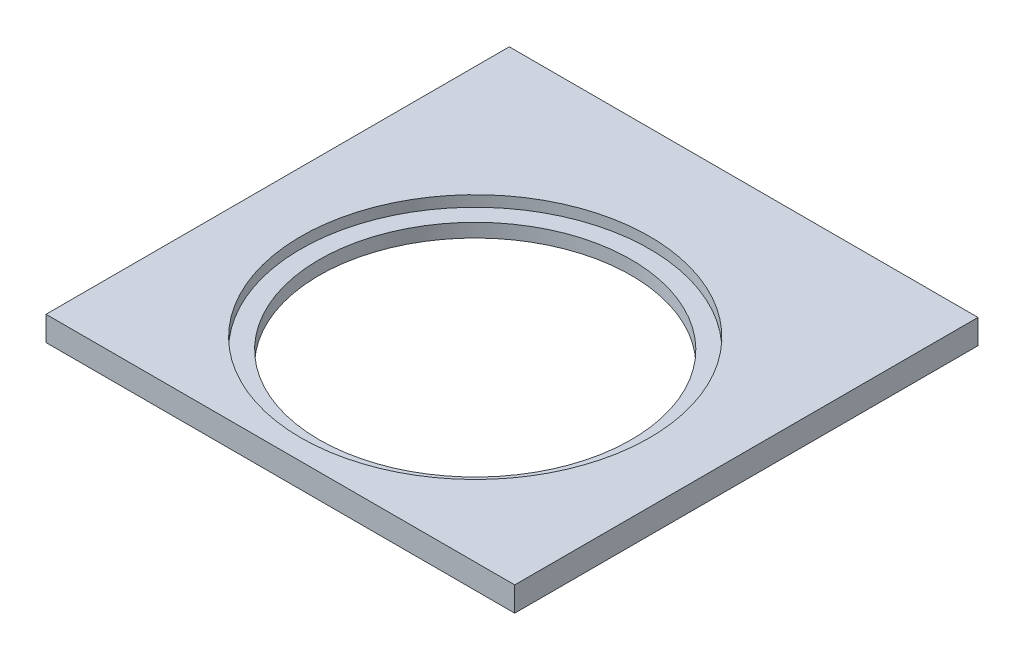
ISO-10303-21;
HEADER;
FILE_DESCRIPTION(('STEP AP214'),'2;1');
FILE_NAME('part.step','',(''),(''),'','','');
FILE_SCHEMA(('AUTOMOTIVE_DESIGN { 1 0 10303 214 1 1 1 1 }'));
ENDSEC;
DATA;
#1=APPLICATION_CONTEXT('core data for automotive mechanical design processes');
#2=APPLICATION_PROTOCOL_DEFINITION('international standard','automotive_design',2000,#1);
#3=PRODUCT_CONTEXT('',#1,'mechanical');
#4=PRODUCT('Part','Part','',(#3));
#5=PRODUCT_RELATED_PRODUCT_CATEGORY('part','',(#4));
#6=PRODUCT_DEFINITION_FORMATION('','',#4);
#7=PRODUCT_DEFINITION_CONTEXT('part definition',#1,'design');
#8=PRODUCT_DEFINITION('design','',#6,#7);
#9=PRODUCT_DEFINITION_SHAPE('','',#8);
#10=(LENGTH_UNIT() NAMED_UNIT(*) SI_UNIT(.MILLI.,.METRE.));
#11=(NAMED_UNIT(*) PLANE_ANGLE_UNIT() SI_UNIT($,.RADIAN.));
#12=(NAMED_UNIT(*) SI_UNIT($,.STERADIAN.) SOLID_ANGLE_UNIT());
#13=UNCERTAINTY_MEASURE_WITH_UNIT(LENGTH_MEASURE(1.E-05),#10,'distance_accuracy_value','');
#14=(GEOMETRIC_REPRESENTATION_CONTEXT(3) GLOBAL_UNCERTAINTY_ASSIGNED_CONTEXT((#13)) GLOBAL_UNIT_ASSIGNED_CONTEXT((#10,
#11,#12)) REPRESENTATION_CONTEXT('',''));
#15=CARTESIAN_POINT('',(0.,0.,0.));
#16=DIRECTION('',(0.,0.,1.));
#17=DIRECTION('',(1.,0.,0.));
#18=AXIS2_PLACEMENT_3D('',#15,#16,#17);
#19=CARTESIAN_POINT('',(0.,0.,27.));
#20=DIRECTION('',(0.,1.,0.));
#21=DIRECTION('',(0.,0.,1.));
#22=AXIS2_PLACEMENT_3D('',#19,#20,#21);
#23=CYLINDRICAL_SURFACE('',#22,114.5);
#24=CARTESIAN_POINT('',(0.,0.,27.));
#25=DIRECTION('',(0.,1.,0.));
#26=DIRECTION('',(0.,0.,1.));
#27=AXIS2_PLACEMENT_3D('',#24,#25,#26);
#28=CIRCLE('',#27,114.5);
#29=CARTESIAN_POINT('',(0.,0.,141.5));
#30=VERTEX_POINT('',#29);
#31=EDGE_CURVE('E104',#30,#30,#28,.T.);
#32=ORIENTED_EDGE('',*,*,#31,.F.);
#33=EDGE_LOOP('',(#32));
#34=FACE_BOUND('',#33,.T.);
#35=CARTESIAN_POINT('',(0.,10.,27.));
#36=DIRECTION('',(0.,1.,0.));
#37=DIRECTION('',(0.,0.,1.));
#38=AXIS2_PLACEMENT_3D('',#35,#36,#37);
#39=CIRCLE('',#38,114.5);
#40=CARTESIAN_POINT('',(0.,10.,141.5));
#41=VERTEX_POINT('',#40);
#42=EDGE_CURVE('E39',#41,#41,#39,.F.);
#43=ORIENTED_EDGE('',*,*,#42,.F.);
#44=EDGE_LOOP('',(#43));
#45=FACE_BOUND('',#44,.T.);
#46=ADVANCED_FACE('F35',(#34,#45),#23,.F.);
#47=CARTESIAN_POINT('',(-172.,18.,170.));
#48=DIRECTION('',(1.,0.,0.));
#49=DIRECTION('',(0.,0.,-1.));
#50=AXIS2_PLACEMENT_3D('',#47,#48,#49);
#51=PLANE('',#50);
#52=DIRECTION('',(0.,0.,1.));
#53=VECTOR('',#52,1.);
#54=CARTESIAN_POINT('',(-172.,0.,170.));
#55=LINE('',#54,#53);
#56=CARTESIAN_POINT('',(-172.,0.,-170.));
#57=VERTEX_POINT('',#56);
#58=CARTESIAN_POINT('',(-172.,0.,170.));
#59=VERTEX_POINT('',#58);
#60=EDGE_CURVE('E101',#57,#59,#55,.T.);
#61=ORIENTED_EDGE('',*,*,#60,.T.);
#62=DIRECTION('',(0.,-1.,0.));
#63=VECTOR('',#62,1.);
#64=CARTESIAN_POINT('',(-172.,18.,170.));
#65=LINE('',#64,#63);
#66=CARTESIAN_POINT('',(-172.,18.,170.));
#67=VERTEX_POINT('',#66);
#68=EDGE_CURVE('E11',#67,#59,#65,.T.);
#69=ORIENTED_EDGE('',*,*,#68,.F.);
#70=DIRECTION('',(0.,0.,1.));
#71=VECTOR('',#70,1.);
#72=CARTESIAN_POINT('',(-172.,18.,170.));
#73=LINE('',#72,#71);
#74=CARTESIAN_POINT('',(-172.,18.,-170.));
#75=VERTEX_POINT('',#74);
#76=EDGE_CURVE('E88',#75,#67,#73,.T.);
#77=ORIENTED_EDGE('',*,*,#76,.F.);
#78=DIRECTION('',(0.,-1.,0.));
#79=VECTOR('',#78,1.);
#80=CARTESIAN_POINT('',(-172.,18.,-170.));
#81=LINE('',#80,#79);
#82=EDGE_CURVE('E97',#75,#57,#81,.T.);
#83=ORIENTED_EDGE('',*,*,#82,.T.);
#84=EDGE_LOOP('',(#61,#69,#77,#83));
#85=FACE_BOUND('',#84,.T.);
#86=ADVANCED_FACE('F37',(#85),#51,.F.);
#87=CARTESIAN_POINT('',(172.,18.,170.));
#88=DIRECTION('',(0.,0.,-1.));
#89=DIRECTION('',(-1.,0.,0.));
#90=AXIS2_PLACEMENT_3D('',#87,#88,#89);
#91=PLANE('',#90);
#92=DIRECTION('',(1.,0.,0.));
#93=VECTOR('',#92,1.);
#94=CARTESIAN_POINT('',(172.,0.,170.));
#95=LINE('',#94,#93);
#96=CARTESIAN_POINT('',(172.,0.,170.));
#97=VERTEX_POINT('',#96);
#98=EDGE_CURVE('E92',#59,#97,#95,.T.);
#99=ORIENTED_EDGE('',*,*,#98,.T.);
#100=DIRECTION('',(0.,-1.,0.));
#101=VECTOR('',#100,1.);
#102=CARTESIAN_POINT('',(172.,18.,170.));
#103=LINE('',#102,#101);
#104=CARTESIAN_POINT('',(172.,18.,170.));
#105=VERTEX_POINT('',#104);
#106=EDGE_CURVE('E45',#105,#97,#103,.T.);
#107=ORIENTED_EDGE('',*,*,#106,.F.);
#108=DIRECTION('',(1.,0.,0.));
#109=VECTOR('',#108,1.);
#110=CARTESIAN_POINT('',(172.,18.,170.));
#111=LINE('',#110,#109);
#112=EDGE_CURVE('E83',#67,#105,#111,.T.);
#113=ORIENTED_EDGE('',*,*,#112,.F.);
#114=ORIENTED_EDGE('',*,*,#68,.T.);
#115=EDGE_LOOP('',(#99,#107,#113,#114));
#116=FACE_BOUND('',#115,.T.);
#117=ADVANCED_FACE('F91',(#116),#91,.F.);
#118=CARTESIAN_POINT('',(172.,18.,170.));
#119=DIRECTION('',(-1.,0.,0.));
#120=DIRECTION('',(0.,0.,1.));
#121=AXIS2_PLACEMENT_3D('',#118,#119,#120);
#122=PLANE('',#121);
#123=DIRECTION('',(0.,0.,-1.));
#124=VECTOR('',#123,1.);
#125=CARTESIAN_POINT('',(172.,0.,170.));
#126=LINE('',#125,#124);
#127=CARTESIAN_POINT('',(172.,0.,-170.));
#128=VERTEX_POINT('',#127);
#129=EDGE_CURVE('E70',#97,#128,#126,.T.);
#130=ORIENTED_EDGE('',*,*,#129,.T.);
#131=DIRECTION('',(0.,-1.,0.));
#132=VECTOR('',#131,1.);
#133=CARTESIAN_POINT('',(172.,18.,-170.));
#134=LINE('',#133,#132);
#135=CARTESIAN_POINT('',(172.,18.,-170.));
#136=VERTEX_POINT('',#135);
#137=EDGE_CURVE('E93',#136,#128,#134,.T.);
#138=ORIENTED_EDGE('',*,*,#137,.F.);
#139=DIRECTION('',(0.,0.,-1.));
#140=VECTOR('',#139,1.);
#141=CARTESIAN_POINT('',(172.,18.,170.));
#142=LINE('',#141,#140);
#143=EDGE_CURVE('E86',#105,#136,#142,.T.);
#144=ORIENTED_EDGE('',*,*,#143,.F.);
#145=ORIENTED_EDGE('',*,*,#106,.T.);
#146=EDGE_LOOP('',(#130,#138,#144,#145));
#147=FACE_BOUND('',#146,.T.);
#148=ADVANCED_FACE('F95',(#147),#122,.F.);
#149=CARTESIAN_POINT('',(172.,18.,-170.));
#150=DIRECTION('',(0.,0.,1.));
#151=DIRECTION('',(1.,0.,0.));
#152=AXIS2_PLACEMENT_3D('',#149,#150,#151);
#153=PLANE('',#152);
#154=DIRECTION('',(-1.,0.,0.));
#155=VECTOR('',#154,1.);
#156=CARTESIAN_POINT('',(172.,0.,-170.));
#157=LINE('',#156,#155);
#158=EDGE_CURVE('E76',#128,#57,#157,.T.);
#159=ORIENTED_EDGE('',*,*,#158,.T.);
#160=ORIENTED_EDGE('',*,*,#82,.F.);
#161=DIRECTION('',(-1.,0.,0.));
#162=VECTOR('',#161,1.);
#163=CARTESIAN_POINT('',(172.,18.,-170.));
#164=LINE('',#163,#162);
#165=EDGE_CURVE('E53',#136,#75,#164,.T.);
#166=ORIENTED_EDGE('',*,*,#165,.F.);
#167=ORIENTED_EDGE('',*,*,#137,.T.);
#168=EDGE_LOOP('',(#159,#160,#166,#167));
#169=FACE_BOUND('',#168,.T.);
#170=ADVANCED_FACE('F109',(#169),#153,.F.);
#171=CARTESIAN_POINT('',(0.,18.,0.));
#172=DIRECTION('',(0.,1.,0.));
#173=DIRECTION('',(0.,0.,1.));
#174=AXIS2_PLACEMENT_3D('',#171,#172,#173);
#175=PLANE('',#174);
#176=CARTESIAN_POINT('',(0.,18.,27.));
#177=DIRECTION('',(0.,1.,0.));
#178=DIRECTION('',(0.,0.,1.));
#179=AXIS2_PLACEMENT_3D('',#176,#177,#178);
#180=CIRCLE('',#179,128.);
#181=CARTESIAN_POINT('',(0.,18.,155.));
#182=VERTEX_POINT('',#181);
#183=EDGE_CURVE('E117',#182,#182,#180,.T.);
#184=ORIENTED_EDGE('',*,*,#183,.F.);
#185=EDGE_LOOP('',(#184));
#186=FACE_BOUND('',#185,.T.);
#187=ORIENTED_EDGE('',*,*,#76,.T.);
#188=ORIENTED_EDGE('',*,*,#112,.T.);
#189=ORIENTED_EDGE('',*,*,#143,.T.);
#190=ORIENTED_EDGE('',*,*,#165,.T.);
#191=EDGE_LOOP('',(#187,#188,#189,#190));
#192=FACE_BOUND('',#191,.T.);
#193=ADVANCED_FACE('F84',(#186,#192),#175,.T.);
#194=CARTESIAN_POINT('',(0.,0.,0.));
#195=DIRECTION('',(0.,1.,0.));
#196=DIRECTION('',(0.,0.,1.));
#197=AXIS2_PLACEMENT_3D('',#194,#195,#196);
#198=PLANE('',#197);
#199=ORIENTED_EDGE('',*,*,#31,.T.);
#200=EDGE_LOOP('',(#199));
#201=FACE_BOUND('',#200,.T.);
#202=ORIENTED_EDGE('',*,*,#60,.F.);
#203=ORIENTED_EDGE('',*,*,#158,.F.);
#204=ORIENTED_EDGE('',*,*,#129,.F.);
#205=ORIENTED_EDGE('',*,*,#98,.F.);
#206=EDGE_LOOP('',(#202,#203,#204,#205));
#207=FACE_BOUND('',#206,.T.);
#208=ADVANCED_FACE('F112',(#201,#207),#198,.F.);
#209=CARTESIAN_POINT('',(0.,10.,27.));
#210=DIRECTION('',(0.,1.,0.));
#211=DIRECTION('',(0.,0.,1.));
#212=AXIS2_PLACEMENT_3D('',#209,#210,#211);
#213=PLANE('',#212);
#214=CARTESIAN_POINT('',(0.,10.,27.));
#215=DIRECTION('',(0.,1.,0.));
#216=DIRECTION('',(0.,0.,1.));
#217=AXIS2_PLACEMENT_3D('',#214,#215,#216);
#218=CIRCLE('',#217,128.);
#219=CARTESIAN_POINT('',(0.,10.,155.));
#220=VERTEX_POINT('',#219);
#221=EDGE_CURVE('E120',#220,#220,#218,.T.);
#222=ORIENTED_EDGE('',*,*,#221,.T.);
#223=EDGE_LOOP('',(#222));
#224=FACE_BOUND('',#223,.T.);
#225=ORIENTED_EDGE('',*,*,#42,.T.);
#226=EDGE_LOOP('',(#225));
#227=FACE_BOUND('',#226,.T.);
#228=ADVANCED_FACE('F127',(#224,#227),#213,.T.);
#229=CARTESIAN_POINT('',(0.,10.,27.));
#230=DIRECTION('',(0.,1.,0.));
#231=DIRECTION('',(0.,0.,1.));
#232=AXIS2_PLACEMENT_3D('',#229,#230,#231);
#233=CYLINDRICAL_SURFACE('',#232,128.);
#234=ORIENTED_EDGE('',*,*,#221,.F.);
#235=EDGE_LOOP('',(#234));
#236=FACE_BOUND('',#235,.T.);
#237=ORIENTED_EDGE('',*,*,#183,.T.);
#238=EDGE_LOOP('',(#237));
#239=FACE_BOUND('',#238,.T.);
#240=ADVANCED_FACE('F138',(#236,#239),#233,.F.);
#241=CLOSED_SHELL('',(#46,#86,#117,#148,#170,#193,#208,#228,#240));
#242=MANIFOLD_SOLID_BREP('B2',#241);
#243=ADVANCED_BREP_SHAPE_REPRESENTATION('',(#18,#242),#14);
#244=SHAPE_DEFINITION_REPRESENTATION(#9,#243);
ENDSEC;
END-ISO-10303-21;
